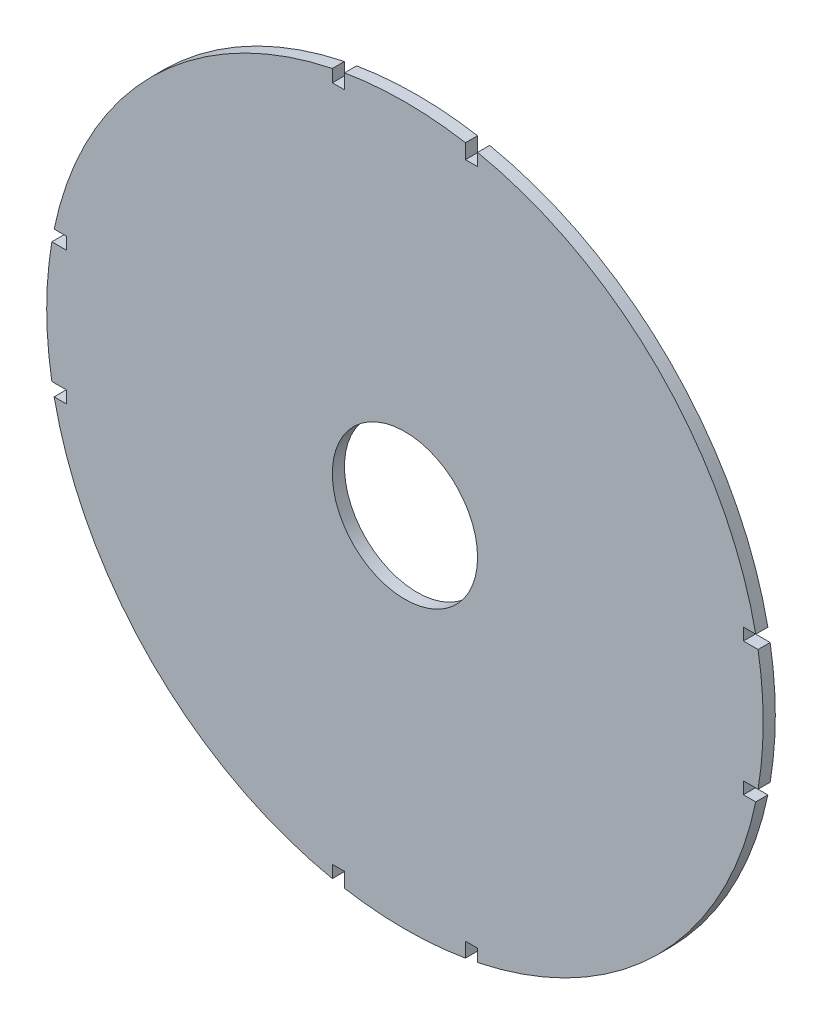
ISO-10303-21;
HEADER;
FILE_DESCRIPTION(('STEP AP214'),'2;1');
FILE_NAME('part.step','',(''),(''),'','','');
FILE_SCHEMA(('AUTOMOTIVE_DESIGN { 1 0 10303 214 1 1 1 1 }'));
ENDSEC;
DATA;
#1=APPLICATION_CONTEXT('core data for automotive mechanical design processes');
#2=APPLICATION_PROTOCOL_DEFINITION('international standard','automotive_design',2000,#1);
#3=PRODUCT_CONTEXT('',#1,'mechanical');
#4=PRODUCT('Part','Part','',(#3));
#5=PRODUCT_RELATED_PRODUCT_CATEGORY('part','',(#4));
#6=PRODUCT_DEFINITION_FORMATION('','',#4);
#7=PRODUCT_DEFINITION_CONTEXT('part definition',#1,'design');
#8=PRODUCT_DEFINITION('design','',#6,#7);
#9=PRODUCT_DEFINITION_SHAPE('','',#8);
#10=(LENGTH_UNIT() NAMED_UNIT(*) SI_UNIT(.MILLI.,.METRE.));
#11=(NAMED_UNIT(*) PLANE_ANGLE_UNIT() SI_UNIT($,.RADIAN.));
#12=(NAMED_UNIT(*) SI_UNIT($,.STERADIAN.) SOLID_ANGLE_UNIT());
#13=UNCERTAINTY_MEASURE_WITH_UNIT(LENGTH_MEASURE(1.E-05),#10,'distance_accuracy_value','');
#14=(GEOMETRIC_REPRESENTATION_CONTEXT(3) GLOBAL_UNCERTAINTY_ASSIGNED_CONTEXT((#13)) GLOBAL_UNIT_ASSIGNED_CONTEXT((#10,
#11,#12)) REPRESENTATION_CONTEXT('',''));
#15=CARTESIAN_POINT('',(0.,0.,0.));
#16=DIRECTION('',(0.,0.,1.));
#17=DIRECTION('',(1.,0.,0.));
#18=AXIS2_PLACEMENT_3D('',#15,#16,#17);
#19=CARTESIAN_POINT('',(0.,15.875,3.175));
#20=DIRECTION('',(0.,-1.,0.));
#21=DIRECTION('',(0.,0.,-1.));
#22=AXIS2_PLACEMENT_3D('',#19,#20,#21);
#23=PLANE('',#22);
#24=DIRECTION('',(-1.,0.,0.));
#25=VECTOR('',#24,1.);
#26=CARTESIAN_POINT('',(0.,15.875,0.));
#27=LINE('',#26,#25);
#28=CARTESIAN_POINT('',(-88.7742364311283,15.875,0.));
#29=VERTEX_POINT('',#28);
#30=CARTESIAN_POINT('',(-92.629502724564,15.875,0.));
#31=VERTEX_POINT('',#30);
#32=EDGE_CURVE('E281',#29,#31,#27,.T.);
#33=ORIENTED_EDGE('',*,*,#32,.T.);
#34=DIRECTION('',(0.,0.,-1.));
#35=VECTOR('',#34,1.);
#36=CARTESIAN_POINT('',(-92.629502724564,15.875,3.175));
#37=LINE('',#36,#35);
#38=CARTESIAN_POINT('',(-92.629502724564,15.875,3.175));
#39=VERTEX_POINT('',#38);
#40=EDGE_CURVE('E11',#39,#31,#37,.T.);
#41=ORIENTED_EDGE('',*,*,#40,.F.);
#42=DIRECTION('',(-1.,0.,0.));
#43=VECTOR('',#42,1.);
#44=CARTESIAN_POINT('',(0.,15.875,3.175));
#45=LINE('',#44,#43);
#46=CARTESIAN_POINT('',(-88.7742364311283,15.875,3.175));
#47=VERTEX_POINT('',#46);
#48=EDGE_CURVE('E449',#47,#39,#45,.T.);
#49=ORIENTED_EDGE('',*,*,#48,.F.);
#50=DIRECTION('',(0.,0.,-1.));
#51=VECTOR('',#50,1.);
#52=CARTESIAN_POINT('',(-88.7742364311283,15.875,3.175));
#53=LINE('',#52,#51);
#54=EDGE_CURVE('E274',#47,#29,#53,.T.);
#55=ORIENTED_EDGE('',*,*,#54,.T.);
#56=EDGE_LOOP('',(#33,#41,#49,#55));
#57=FACE_BOUND('',#56,.T.);
#58=ADVANCED_FACE('F37',(#57),#23,.F.);
#59=CARTESIAN_POINT('',(0.,0.,3.175));
#60=DIRECTION('',(0.,0.,-1.));
#61=DIRECTION('',(-1.,0.,0.));
#62=AXIS2_PLACEMENT_3D('',#59,#60,#61);
#63=CYLINDRICAL_SURFACE('',#62,93.98);
#64=CARTESIAN_POINT('',(0.,0.,0.));
#65=DIRECTION('',(0.,0.,1.));
#66=DIRECTION('',(1.,0.,0.));
#67=AXIS2_PLACEMENT_3D('',#64,#65,#66);
#68=CIRCLE('',#67,93.98);
#69=CARTESIAN_POINT('',(-92.629502724564,-15.875,0.));
#70=VERTEX_POINT('',#69);
#71=EDGE_CURVE('E284',#31,#70,#68,.T.);
#72=ORIENTED_EDGE('',*,*,#71,.T.);
#73=DIRECTION('',(0.,0.,-1.));
#74=VECTOR('',#73,1.);
#75=CARTESIAN_POINT('',(-92.629502724564,-15.875,3.175));
#76=LINE('',#75,#74);
#77=CARTESIAN_POINT('',(-92.629502724564,-15.875,3.175));
#78=VERTEX_POINT('',#77);
#79=EDGE_CURVE('E46',#78,#70,#76,.T.);
#80=ORIENTED_EDGE('',*,*,#79,.F.);
#81=CARTESIAN_POINT('',(0.,0.,3.175));
#82=DIRECTION('',(0.,0.,1.));
#83=DIRECTION('',(1.,0.,0.));
#84=AXIS2_PLACEMENT_3D('',#81,#82,#83);
#85=CIRCLE('',#84,93.98);
#86=EDGE_CURVE('E165',#39,#78,#85,.T.);
#87=ORIENTED_EDGE('',*,*,#86,.F.);
#88=ORIENTED_EDGE('',*,*,#40,.T.);
#89=EDGE_LOOP('',(#72,#80,#87,#88));
#90=FACE_BOUND('',#89,.T.);
#91=ADVANCED_FACE('F432',(#90),#63,.T.);
#92=CARTESIAN_POINT('',(0.,-15.875,3.175));
#93=DIRECTION('',(0.,-1.,0.));
#94=DIRECTION('',(0.,0.,-1.));
#95=AXIS2_PLACEMENT_3D('',#92,#93,#94);
#96=PLANE('',#95);
#97=DIRECTION('',(-1.,0.,0.));
#98=VECTOR('',#97,1.);
#99=CARTESIAN_POINT('',(0.,-15.875,0.));
#100=LINE('',#99,#98);
#101=CARTESIAN_POINT('',(-88.7742364311283,-15.875,0.));
#102=VERTEX_POINT('',#101);
#103=EDGE_CURVE('E287',#102,#70,#100,.T.);
#104=ORIENTED_EDGE('',*,*,#103,.F.);
#105=DIRECTION('',(0.,0.,-1.));
#106=VECTOR('',#105,1.);
#107=CARTESIAN_POINT('',(-88.7742364311283,-15.875,3.175));
#108=LINE('',#107,#106);
#109=CARTESIAN_POINT('',(-88.7742364311283,-15.875,3.175));
#110=VERTEX_POINT('',#109);
#111=EDGE_CURVE('E425',#110,#102,#108,.T.);
#112=ORIENTED_EDGE('',*,*,#111,.F.);
#113=DIRECTION('',(-1.,0.,0.));
#114=VECTOR('',#113,1.);
#115=CARTESIAN_POINT('',(0.,-15.875,3.175));
#116=LINE('',#115,#114);
#117=EDGE_CURVE('E431',#110,#78,#116,.T.);
#118=ORIENTED_EDGE('',*,*,#117,.T.);
#119=ORIENTED_EDGE('',*,*,#79,.T.);
#120=EDGE_LOOP('',(#104,#112,#118,#119));
#121=FACE_BOUND('',#120,.T.);
#122=ADVANCED_FACE('F429',(#121),#96,.T.);
#123=CARTESIAN_POINT('',(-88.7742364311283,0.,3.175));
#124=DIRECTION('',(-1.,0.,0.));
#125=DIRECTION('',(0.,0.,1.));
#126=AXIS2_PLACEMENT_3D('',#123,#124,#125);
#127=PLANE('',#126);
#128=DIRECTION('',(0.,1.,0.));
#129=VECTOR('',#128,1.);
#130=CARTESIAN_POINT('',(-88.7742364311283,0.,0.));
#131=LINE('',#130,#129);
#132=CARTESIAN_POINT('',(-88.7742364311283,-19.05,0.));
#133=VERTEX_POINT('',#132);
#134=EDGE_CURVE('E290',#133,#102,#131,.T.);
#135=ORIENTED_EDGE('',*,*,#134,.F.);
#136=DIRECTION('',(0.,0.,-1.));
#137=VECTOR('',#136,1.);
#138=CARTESIAN_POINT('',(-88.7742364311283,-19.05,3.175));
#139=LINE('',#138,#137);
#140=CARTESIAN_POINT('',(-88.7742364311283,-19.05,3.175));
#141=VERTEX_POINT('',#140);
#142=EDGE_CURVE('E423',#141,#133,#139,.T.);
#143=ORIENTED_EDGE('',*,*,#142,.F.);
#144=DIRECTION('',(0.,1.,0.));
#145=VECTOR('',#144,1.);
#146=CARTESIAN_POINT('',(-88.7742364311283,0.,3.175));
#147=LINE('',#146,#145);
#148=EDGE_CURVE('E445',#141,#110,#147,.T.);
#149=ORIENTED_EDGE('',*,*,#148,.T.);
#150=ORIENTED_EDGE('',*,*,#111,.T.);
#151=EDGE_LOOP('',(#135,#143,#149,#150));
#152=FACE_BOUND('',#151,.T.);
#153=ADVANCED_FACE('F441',(#152),#127,.T.);
#154=CARTESIAN_POINT('',(0.,-19.05,3.175));
#155=DIRECTION('',(0.,-1.,0.));
#156=DIRECTION('',(0.,0.,-1.));
#157=AXIS2_PLACEMENT_3D('',#154,#155,#156);
#158=PLANE('',#157);
#159=DIRECTION('',(-1.,0.,0.));
#160=VECTOR('',#159,1.);
#161=CARTESIAN_POINT('',(0.,-19.05,0.));
#162=LINE('',#161,#160);
#163=CARTESIAN_POINT('',(-92.029005753621,-19.05,0.));
#164=VERTEX_POINT('',#163);
#165=EDGE_CURVE('E293',#133,#164,#162,.T.);
#166=ORIENTED_EDGE('',*,*,#165,.T.);
#167=DIRECTION('',(0.,0.,-1.));
#168=VECTOR('',#167,1.);
#169=CARTESIAN_POINT('',(-92.029005753621,-19.05,3.175));
#170=LINE('',#169,#168);
#171=CARTESIAN_POINT('',(-92.029005753621,-19.05,3.175));
#172=VERTEX_POINT('',#171);
#173=EDGE_CURVE('E420',#172,#164,#170,.T.);
#174=ORIENTED_EDGE('',*,*,#173,.F.);
#175=DIRECTION('',(-1.,0.,0.));
#176=VECTOR('',#175,1.);
#177=CARTESIAN_POINT('',(0.,-19.05,3.175));
#178=LINE('',#177,#176);
#179=EDGE_CURVE('E447',#141,#172,#178,.T.);
#180=ORIENTED_EDGE('',*,*,#179,.F.);
#181=ORIENTED_EDGE('',*,*,#142,.T.);
#182=EDGE_LOOP('',(#166,#174,#180,#181));
#183=FACE_BOUND('',#182,.T.);
#184=ADVANCED_FACE('F540',(#183),#158,.F.);
#185=CARTESIAN_POINT('',(0.,0.,3.175));
#186=DIRECTION('',(0.,0.,-1.));
#187=DIRECTION('',(-1.,0.,0.));
#188=AXIS2_PLACEMENT_3D('',#185,#186,#187);
#189=CYLINDRICAL_SURFACE('',#188,93.98);
#190=CARTESIAN_POINT('',(0.,0.,0.));
#191=DIRECTION('',(0.,0.,1.));
#192=DIRECTION('',(1.,0.,0.));
#193=AXIS2_PLACEMENT_3D('',#190,#191,#192);
#194=CIRCLE('',#193,93.98);
#195=CARTESIAN_POINT('',(-19.05,-92.029005753621,0.));
#196=VERTEX_POINT('',#195);
#197=EDGE_CURVE('E295',#164,#196,#194,.T.);
#198=ORIENTED_EDGE('',*,*,#197,.T.);
#199=DIRECTION('',(0.,0.,-1.));
#200=VECTOR('',#199,1.);
#201=CARTESIAN_POINT('',(-19.05,-92.029005753621,3.175));
#202=LINE('',#201,#200);
#203=CARTESIAN_POINT('',(-19.05,-92.029005753621,3.175));
#204=VERTEX_POINT('',#203);
#205=EDGE_CURVE('E418',#204,#196,#202,.T.);
#206=ORIENTED_EDGE('',*,*,#205,.F.);
#207=CARTESIAN_POINT('',(0.,0.,3.175));
#208=DIRECTION('',(0.,0.,1.));
#209=DIRECTION('',(1.,0.,0.));
#210=AXIS2_PLACEMENT_3D('',#207,#208,#209);
#211=CIRCLE('',#210,93.98);
#212=EDGE_CURVE('E454',#172,#204,#211,.T.);
#213=ORIENTED_EDGE('',*,*,#212,.F.);
#214=ORIENTED_EDGE('',*,*,#173,.T.);
#215=EDGE_LOOP('',(#198,#206,#213,#214));
#216=FACE_BOUND('',#215,.T.);
#217=ADVANCED_FACE('F543',(#216),#189,.T.);
#218=CARTESIAN_POINT('',(-19.0500000000002,0.,3.175));
#219=DIRECTION('',(1.,0.,0.));
#220=DIRECTION('',(0.,1.,0.));
#221=AXIS2_PLACEMENT_3D('',#218,#219,#220);
#222=PLANE('',#221);
#223=DIRECTION('',(0.,-1.,0.));
#224=VECTOR('',#223,1.);
#225=CARTESIAN_POINT('',(-19.0500000000002,0.,0.));
#226=LINE('',#225,#224);
#227=CARTESIAN_POINT('',(-19.05,-88.7742364311283,0.));
#228=VERTEX_POINT('',#227);
#229=EDGE_CURVE('E298',#228,#196,#226,.T.);
#230=ORIENTED_EDGE('',*,*,#229,.F.);
#231=DIRECTION('',(0.,0.,-1.));
#232=VECTOR('',#231,1.);
#233=CARTESIAN_POINT('',(-19.05,-88.7742364311283,3.175));
#234=LINE('',#233,#232);
#235=CARTESIAN_POINT('',(-19.05,-88.7742364311283,3.175));
#236=VERTEX_POINT('',#235);
#237=EDGE_CURVE('E416',#236,#228,#234,.T.);
#238=ORIENTED_EDGE('',*,*,#237,.F.);
#239=DIRECTION('',(0.,-1.,0.));
#240=VECTOR('',#239,1.);
#241=CARTESIAN_POINT('',(-19.0500000000002,0.,3.175));
#242=LINE('',#241,#240);
#243=EDGE_CURVE('E456',#236,#204,#242,.T.);
#244=ORIENTED_EDGE('',*,*,#243,.T.);
#245=ORIENTED_EDGE('',*,*,#205,.T.);
#246=EDGE_LOOP('',(#230,#238,#244,#245));
#247=FACE_BOUND('',#246,.T.);
#248=ADVANCED_FACE('F547',(#247),#222,.T.);
#249=CARTESIAN_POINT('',(0.,-88.7742364311283,3.175));
#250=DIRECTION('',(0.,1.,0.));
#251=DIRECTION('',(0.,0.,1.));
#252=AXIS2_PLACEMENT_3D('',#249,#250,#251);
#253=PLANE('',#252);
#254=DIRECTION('',(1.,0.,0.));
#255=VECTOR('',#254,1.);
#256=CARTESIAN_POINT('',(0.,-88.7742364311283,0.));
#257=LINE('',#256,#255);
#258=CARTESIAN_POINT('',(-15.875,-88.7742364311283,0.));
#259=VERTEX_POINT('',#258);
#260=EDGE_CURVE('E301',#228,#259,#257,.T.);
#261=ORIENTED_EDGE('',*,*,#260,.T.);
#262=DIRECTION('',(0.,0.,-1.));
#263=VECTOR('',#262,1.);
#264=CARTESIAN_POINT('',(-15.875,-88.7742364311283,3.175));
#265=LINE('',#264,#263);
#266=CARTESIAN_POINT('',(-15.875,-88.7742364311283,3.175));
#267=VERTEX_POINT('',#266);
#268=EDGE_CURVE('E413',#267,#259,#265,.T.);
#269=ORIENTED_EDGE('',*,*,#268,.F.);
#270=DIRECTION('',(1.,0.,0.));
#271=VECTOR('',#270,1.);
#272=CARTESIAN_POINT('',(0.,-88.7742364311283,3.175));
#273=LINE('',#272,#271);
#274=EDGE_CURVE('E459',#236,#267,#273,.T.);
#275=ORIENTED_EDGE('',*,*,#274,.F.);
#276=ORIENTED_EDGE('',*,*,#237,.T.);
#277=EDGE_LOOP('',(#261,#269,#275,#276));
#278=FACE_BOUND('',#277,.T.);
#279=ADVANCED_FACE('F551',(#278),#253,.F.);
#280=CARTESIAN_POINT('',(-15.875,0.,3.175));
#281=DIRECTION('',(1.,0.,0.));
#282=DIRECTION('',(0.,0.,-1.));
#283=AXIS2_PLACEMENT_3D('',#280,#281,#282);
#284=PLANE('',#283);
#285=DIRECTION('',(0.,-1.,0.));
#286=VECTOR('',#285,1.);
#287=CARTESIAN_POINT('',(-15.875,0.,0.));
#288=LINE('',#287,#286);
#289=CARTESIAN_POINT('',(-15.875,-92.629502724564,0.));
#290=VERTEX_POINT('',#289);
#291=EDGE_CURVE('E303',#259,#290,#288,.T.);
#292=ORIENTED_EDGE('',*,*,#291,.T.);
#293=DIRECTION('',(0.,0.,-1.));
#294=VECTOR('',#293,1.);
#295=CARTESIAN_POINT('',(-15.875,-92.629502724564,3.175));
#296=LINE('',#295,#294);
#297=CARTESIAN_POINT('',(-15.875,-92.629502724564,3.175));
#298=VERTEX_POINT('',#297);
#299=EDGE_CURVE('E410',#298,#290,#296,.T.);
#300=ORIENTED_EDGE('',*,*,#299,.F.);
#301=DIRECTION('',(0.,-1.,0.));
#302=VECTOR('',#301,1.);
#303=CARTESIAN_POINT('',(-15.875,0.,3.175));
#304=LINE('',#303,#302);
#305=EDGE_CURVE('E461',#267,#298,#304,.T.);
#306=ORIENTED_EDGE('',*,*,#305,.F.);
#307=ORIENTED_EDGE('',*,*,#268,.T.);
#308=EDGE_LOOP('',(#292,#300,#306,#307));
#309=FACE_BOUND('',#308,.T.);
#310=ADVANCED_FACE('F555',(#309),#284,.F.);
#311=CARTESIAN_POINT('',(0.,0.,3.175));
#312=DIRECTION('',(0.,0.,-1.));
#313=DIRECTION('',(-1.,0.,0.));
#314=AXIS2_PLACEMENT_3D('',#311,#312,#313);
#315=CYLINDRICAL_SURFACE('',#314,93.98);
#316=CARTESIAN_POINT('',(0.,0.,0.));
#317=DIRECTION('',(0.,0.,1.));
#318=DIRECTION('',(1.,0.,0.));
#319=AXIS2_PLACEMENT_3D('',#316,#317,#318);
#320=CIRCLE('',#319,93.98);
#321=CARTESIAN_POINT('',(15.875,-92.629502724564,0.));
#322=VERTEX_POINT('',#321);
#323=EDGE_CURVE('E305',#290,#322,#320,.T.);
#324=ORIENTED_EDGE('',*,*,#323,.T.);
#325=DIRECTION('',(0.,0.,-1.));
#326=VECTOR('',#325,1.);
#327=CARTESIAN_POINT('',(15.875,-92.629502724564,3.175));
#328=LINE('',#327,#326);
#329=CARTESIAN_POINT('',(15.875,-92.629502724564,3.175));
#330=VERTEX_POINT('',#329);
#331=EDGE_CURVE('E408',#330,#322,#328,.T.);
#332=ORIENTED_EDGE('',*,*,#331,.F.);
#333=CARTESIAN_POINT('',(0.,0.,3.175));
#334=DIRECTION('',(0.,0.,1.));
#335=DIRECTION('',(1.,0.,0.));
#336=AXIS2_PLACEMENT_3D('',#333,#334,#335);
#337=CIRCLE('',#336,93.98);
#338=EDGE_CURVE('E463',#298,#330,#337,.T.);
#339=ORIENTED_EDGE('',*,*,#338,.F.);
#340=ORIENTED_EDGE('',*,*,#299,.T.);
#341=EDGE_LOOP('',(#324,#332,#339,#340));
#342=FACE_BOUND('',#341,.T.);
#343=ADVANCED_FACE('F559',(#342),#315,.T.);
#344=CARTESIAN_POINT('',(15.875,0.,3.175));
#345=DIRECTION('',(1.,0.,0.));
#346=DIRECTION('',(0.,0.,-1.));
#347=AXIS2_PLACEMENT_3D('',#344,#345,#346);
#348=PLANE('',#347);
#349=DIRECTION('',(0.,-1.,0.));
#350=VECTOR('',#349,1.);
#351=CARTESIAN_POINT('',(15.875,0.,0.));
#352=LINE('',#351,#350);
#353=CARTESIAN_POINT('',(15.875,-88.7742364311283,0.));
#354=VERTEX_POINT('',#353);
#355=EDGE_CURVE('E308',#354,#322,#352,.T.);
#356=ORIENTED_EDGE('',*,*,#355,.F.);
#357=DIRECTION('',(0.,0.,-1.));
#358=VECTOR('',#357,1.);
#359=CARTESIAN_POINT('',(15.875,-88.7742364311283,3.175));
#360=LINE('',#359,#358);
#361=CARTESIAN_POINT('',(15.875,-88.7742364311283,3.175));
#362=VERTEX_POINT('',#361);
#363=EDGE_CURVE('E406',#362,#354,#360,.T.);
#364=ORIENTED_EDGE('',*,*,#363,.F.);
#365=DIRECTION('',(0.,-1.,0.));
#366=VECTOR('',#365,1.);
#367=CARTESIAN_POINT('',(15.875,0.,3.175));
#368=LINE('',#367,#366);
#369=EDGE_CURVE('E465',#362,#330,#368,.T.);
#370=ORIENTED_EDGE('',*,*,#369,.T.);
#371=ORIENTED_EDGE('',*,*,#331,.T.);
#372=EDGE_LOOP('',(#356,#364,#370,#371));
#373=FACE_BOUND('',#372,.T.);
#374=ADVANCED_FACE('F563',(#373),#348,.T.);
#375=CARTESIAN_POINT('',(0.,-88.7742364311283,3.175));
#376=DIRECTION('',(0.,-1.,0.));
#377=DIRECTION('',(0.,0.,-1.));
#378=AXIS2_PLACEMENT_3D('',#375,#376,#377);
#379=PLANE('',#378);
#380=DIRECTION('',(-1.,0.,0.));
#381=VECTOR('',#380,1.);
#382=CARTESIAN_POINT('',(0.,-88.7742364311283,0.));
#383=LINE('',#382,#381);
#384=CARTESIAN_POINT('',(19.05,-88.7742364311283,0.));
#385=VERTEX_POINT('',#384);
#386=EDGE_CURVE('E311',#385,#354,#383,.T.);
#387=ORIENTED_EDGE('',*,*,#386,.F.);
#388=DIRECTION('',(0.,0.,-1.));
#389=VECTOR('',#388,1.);
#390=CARTESIAN_POINT('',(19.05,-88.7742364311283,3.175));
#391=LINE('',#390,#389);
#392=CARTESIAN_POINT('',(19.05,-88.7742364311283,3.175));
#393=VERTEX_POINT('',#392);
#394=EDGE_CURVE('E404',#393,#385,#391,.T.);
#395=ORIENTED_EDGE('',*,*,#394,.F.);
#396=DIRECTION('',(-1.,0.,0.));
#397=VECTOR('',#396,1.);
#398=CARTESIAN_POINT('',(0.,-88.7742364311283,3.175));
#399=LINE('',#398,#397);
#400=EDGE_CURVE('E468',#393,#362,#399,.T.);
#401=ORIENTED_EDGE('',*,*,#400,.T.);
#402=ORIENTED_EDGE('',*,*,#363,.T.);
#403=EDGE_LOOP('',(#387,#395,#401,#402));
#404=FACE_BOUND('',#403,.T.);
#405=ADVANCED_FACE('F567',(#404),#379,.T.);
#406=CARTESIAN_POINT('',(19.0500000000002,0.,3.175));
#407=DIRECTION('',(1.,0.,0.));
#408=DIRECTION('',(0.,1.,0.));
#409=AXIS2_PLACEMENT_3D('',#406,#407,#408);
#410=PLANE('',#409);
#411=DIRECTION('',(0.,-1.,0.));
#412=VECTOR('',#411,1.);
#413=CARTESIAN_POINT('',(19.0500000000002,0.,0.));
#414=LINE('',#413,#412);
#415=CARTESIAN_POINT('',(19.05,-92.029005753621,0.));
#416=VERTEX_POINT('',#415);
#417=EDGE_CURVE('E314',#385,#416,#414,.T.);
#418=ORIENTED_EDGE('',*,*,#417,.T.);
#419=DIRECTION('',(0.,0.,-1.));
#420=VECTOR('',#419,1.);
#421=CARTESIAN_POINT('',(19.05,-92.029005753621,3.175));
#422=LINE('',#421,#420);
#423=CARTESIAN_POINT('',(19.05,-92.029005753621,3.175));
#424=VERTEX_POINT('',#423);
#425=EDGE_CURVE('E401',#424,#416,#422,.T.);
#426=ORIENTED_EDGE('',*,*,#425,.F.);
#427=DIRECTION('',(0.,-1.,0.));
#428=VECTOR('',#427,1.);
#429=CARTESIAN_POINT('',(19.0500000000002,0.,3.175));
#430=LINE('',#429,#428);
#431=EDGE_CURVE('E471',#393,#424,#430,.T.);
#432=ORIENTED_EDGE('',*,*,#431,.F.);
#433=ORIENTED_EDGE('',*,*,#394,.T.);
#434=EDGE_LOOP('',(#418,#426,#432,#433));
#435=FACE_BOUND('',#434,.T.);
#436=ADVANCED_FACE('F571',(#435),#410,.F.);
#437=CARTESIAN_POINT('',(0.,0.,3.175));
#438=DIRECTION('',(0.,0.,-1.));
#439=DIRECTION('',(-1.,0.,0.));
#440=AXIS2_PLACEMENT_3D('',#437,#438,#439);
#441=CYLINDRICAL_SURFACE('',#440,93.98);
#442=CARTESIAN_POINT('',(0.,0.,0.));
#443=DIRECTION('',(0.,0.,1.));
#444=DIRECTION('',(1.,0.,0.));
#445=AXIS2_PLACEMENT_3D('',#442,#443,#444);
#446=CIRCLE('',#445,93.98);
#447=CARTESIAN_POINT('',(92.029005753621,-19.05,0.));
#448=VERTEX_POINT('',#447);
#449=EDGE_CURVE('E316',#416,#448,#446,.T.);
#450=ORIENTED_EDGE('',*,*,#449,.T.);
#451=DIRECTION('',(0.,0.,-1.));
#452=VECTOR('',#451,1.);
#453=CARTESIAN_POINT('',(92.029005753621,-19.05,3.175));
#454=LINE('',#453,#452);
#455=CARTESIAN_POINT('',(92.029005753621,-19.05,3.175));
#456=VERTEX_POINT('',#455);
#457=EDGE_CURVE('E399',#456,#448,#454,.T.);
#458=ORIENTED_EDGE('',*,*,#457,.F.);
#459=CARTESIAN_POINT('',(0.,0.,3.175));
#460=DIRECTION('',(0.,0.,1.));
#461=DIRECTION('',(1.,0.,0.));
#462=AXIS2_PLACEMENT_3D('',#459,#460,#461);
#463=CIRCLE('',#462,93.98);
#464=EDGE_CURVE('E473',#424,#456,#463,.T.);
#465=ORIENTED_EDGE('',*,*,#464,.F.);
#466=ORIENTED_EDGE('',*,*,#425,.T.);
#467=EDGE_LOOP('',(#450,#458,#465,#466));
#468=FACE_BOUND('',#467,.T.);
#469=ADVANCED_FACE('F575',(#468),#441,.T.);
#470=CARTESIAN_POINT('',(0.,-19.05,3.175));
#471=DIRECTION('',(0.,1.,0.));
#472=DIRECTION('',(0.,0.,1.));
#473=AXIS2_PLACEMENT_3D('',#470,#471,#472);
#474=PLANE('',#473);
#475=DIRECTION('',(1.,0.,0.));
#476=VECTOR('',#475,1.);
#477=CARTESIAN_POINT('',(0.,-19.05,0.));
#478=LINE('',#477,#476);
#479=CARTESIAN_POINT('',(88.7742364311283,-19.05,0.));
#480=VERTEX_POINT('',#479);
#481=EDGE_CURVE('E319',#480,#448,#478,.T.);
#482=ORIENTED_EDGE('',*,*,#481,.F.);
#483=DIRECTION('',(0.,0.,-1.));
#484=VECTOR('',#483,1.);
#485=CARTESIAN_POINT('',(88.7742364311283,-19.05,3.175));
#486=LINE('',#485,#484);
#487=CARTESIAN_POINT('',(88.7742364311283,-19.05,3.175));
#488=VERTEX_POINT('',#487);
#489=EDGE_CURVE('E397',#488,#480,#486,.T.);
#490=ORIENTED_EDGE('',*,*,#489,.F.);
#491=DIRECTION('',(1.,0.,0.));
#492=VECTOR('',#491,1.);
#493=CARTESIAN_POINT('',(0.,-19.05,3.175));
#494=LINE('',#493,#492);
#495=EDGE_CURVE('E475',#488,#456,#494,.T.);
#496=ORIENTED_EDGE('',*,*,#495,.T.);
#497=ORIENTED_EDGE('',*,*,#457,.T.);
#498=EDGE_LOOP('',(#482,#490,#496,#497));
#499=FACE_BOUND('',#498,.T.);
#500=ADVANCED_FACE('F579',(#499),#474,.T.);
#501=CARTESIAN_POINT('',(88.7742364311283,0.,3.175));
#502=DIRECTION('',(-1.,0.,0.));
#503=DIRECTION('',(0.,0.,1.));
#504=AXIS2_PLACEMENT_3D('',#501,#502,#503);
#505=PLANE('',#504);
#506=DIRECTION('',(0.,1.,0.));
#507=VECTOR('',#506,1.);
#508=CARTESIAN_POINT('',(88.7742364311283,0.,0.));
#509=LINE('',#508,#507);
#510=CARTESIAN_POINT('',(88.7742364311283,-15.875,0.));
#511=VERTEX_POINT('',#510);
#512=EDGE_CURVE('E322',#480,#511,#509,.T.);
#513=ORIENTED_EDGE('',*,*,#512,.T.);
#514=DIRECTION('',(0.,0.,-1.));
#515=VECTOR('',#514,1.);
#516=CARTESIAN_POINT('',(88.7742364311283,-15.875,3.175));
#517=LINE('',#516,#515);
#518=CARTESIAN_POINT('',(88.7742364311283,-15.875,3.175));
#519=VERTEX_POINT('',#518);
#520=EDGE_CURVE('E394',#519,#511,#517,.T.);
#521=ORIENTED_EDGE('',*,*,#520,.F.);
#522=DIRECTION('',(0.,1.,0.));
#523=VECTOR('',#522,1.);
#524=CARTESIAN_POINT('',(88.7742364311283,0.,3.175));
#525=LINE('',#524,#523);
#526=EDGE_CURVE('E478',#488,#519,#525,.T.);
#527=ORIENTED_EDGE('',*,*,#526,.F.);
#528=ORIENTED_EDGE('',*,*,#489,.T.);
#529=EDGE_LOOP('',(#513,#521,#527,#528));
#530=FACE_BOUND('',#529,.T.);
#531=ADVANCED_FACE('F583',(#530),#505,.F.);
#532=CARTESIAN_POINT('',(0.,-15.875,3.175));
#533=DIRECTION('',(0.,1.,0.));
#534=DIRECTION('',(0.,0.,1.));
#535=AXIS2_PLACEMENT_3D('',#532,#533,#534);
#536=PLANE('',#535);
#537=DIRECTION('',(1.,0.,0.));
#538=VECTOR('',#537,1.);
#539=CARTESIAN_POINT('',(0.,-15.875,0.));
#540=LINE('',#539,#538);
#541=CARTESIAN_POINT('',(92.629502724564,-15.875,0.));
#542=VERTEX_POINT('',#541);
#543=EDGE_CURVE('E324',#511,#542,#540,.T.);
#544=ORIENTED_EDGE('',*,*,#543,.T.);
#545=DIRECTION('',(0.,0.,-1.));
#546=VECTOR('',#545,1.);
#547=CARTESIAN_POINT('',(92.629502724564,-15.875,3.175));
#548=LINE('',#547,#546);
#549=CARTESIAN_POINT('',(92.629502724564,-15.875,3.175));
#550=VERTEX_POINT('',#549);
#551=EDGE_CURVE('E391',#550,#542,#548,.T.);
#552=ORIENTED_EDGE('',*,*,#551,.F.);
#553=DIRECTION('',(1.,0.,0.));
#554=VECTOR('',#553,1.);
#555=CARTESIAN_POINT('',(0.,-15.875,3.175));
#556=LINE('',#555,#554);
#557=EDGE_CURVE('E480',#519,#550,#556,.T.);
#558=ORIENTED_EDGE('',*,*,#557,.F.);
#559=ORIENTED_EDGE('',*,*,#520,.T.);
#560=EDGE_LOOP('',(#544,#552,#558,#559));
#561=FACE_BOUND('',#560,.T.);
#562=ADVANCED_FACE('F587',(#561),#536,.F.);
#563=CARTESIAN_POINT('',(0.,0.,3.175));
#564=DIRECTION('',(0.,0.,-1.));
#565=DIRECTION('',(-1.,0.,0.));
#566=AXIS2_PLACEMENT_3D('',#563,#564,#565);
#567=CYLINDRICAL_SURFACE('',#566,93.98);
#568=CARTESIAN_POINT('',(0.,0.,0.));
#569=DIRECTION('',(0.,0.,1.));
#570=DIRECTION('',(1.,0.,0.));
#571=AXIS2_PLACEMENT_3D('',#568,#569,#570);
#572=CIRCLE('',#571,93.98);
#573=CARTESIAN_POINT('',(92.629502724564,15.875,0.));
#574=VERTEX_POINT('',#573);
#575=EDGE_CURVE('E326',#542,#574,#572,.T.);
#576=ORIENTED_EDGE('',*,*,#575,.T.);
#577=DIRECTION('',(0.,0.,-1.));
#578=VECTOR('',#577,1.);
#579=CARTESIAN_POINT('',(92.629502724564,15.875,3.175));
#580=LINE('',#579,#578);
#581=CARTESIAN_POINT('',(92.629502724564,15.875,3.175));
#582=VERTEX_POINT('',#581);
#583=EDGE_CURVE('E389',#582,#574,#580,.T.);
#584=ORIENTED_EDGE('',*,*,#583,.F.);
#585=CARTESIAN_POINT('',(0.,0.,3.175));
#586=DIRECTION('',(0.,0.,1.));
#587=DIRECTION('',(1.,0.,0.));
#588=AXIS2_PLACEMENT_3D('',#585,#586,#587);
#589=CIRCLE('',#588,93.98);
#590=EDGE_CURVE('E482',#550,#582,#589,.T.);
#591=ORIENTED_EDGE('',*,*,#590,.F.);
#592=ORIENTED_EDGE('',*,*,#551,.T.);
#593=EDGE_LOOP('',(#576,#584,#591,#592));
#594=FACE_BOUND('',#593,.T.);
#595=ADVANCED_FACE('F591',(#594),#567,.T.);
#596=CARTESIAN_POINT('',(0.,15.875,3.175));
#597=DIRECTION('',(0.,1.,0.));
#598=DIRECTION('',(0.,0.,1.));
#599=AXIS2_PLACEMENT_3D('',#596,#597,#598);
#600=PLANE('',#599);
#601=DIRECTION('',(1.,0.,0.));
#602=VECTOR('',#601,1.);
#603=CARTESIAN_POINT('',(0.,15.875,0.));
#604=LINE('',#603,#602);
#605=CARTESIAN_POINT('',(88.7742364311283,15.875,0.));
#606=VERTEX_POINT('',#605);
#607=EDGE_CURVE('E329',#606,#574,#604,.T.);
#608=ORIENTED_EDGE('',*,*,#607,.F.);
#609=DIRECTION('',(0.,0.,-1.));
#610=VECTOR('',#609,1.);
#611=CARTESIAN_POINT('',(88.7742364311283,15.875,3.175));
#612=LINE('',#611,#610);
#613=CARTESIAN_POINT('',(88.7742364311283,15.875,3.175));
#614=VERTEX_POINT('',#613);
#615=EDGE_CURVE('E387',#614,#606,#612,.T.);
#616=ORIENTED_EDGE('',*,*,#615,.F.);
#617=DIRECTION('',(1.,0.,0.));
#618=VECTOR('',#617,1.);
#619=CARTESIAN_POINT('',(0.,15.875,3.175));
#620=LINE('',#619,#618);
#621=EDGE_CURVE('E484',#614,#582,#620,.T.);
#622=ORIENTED_EDGE('',*,*,#621,.T.);
#623=ORIENTED_EDGE('',*,*,#583,.T.);
#624=EDGE_LOOP('',(#608,#616,#622,#623));
#625=FACE_BOUND('',#624,.T.);
#626=ADVANCED_FACE('F595',(#625),#600,.T.);
#627=CARTESIAN_POINT('',(88.7742364311283,0.,3.175));
#628=DIRECTION('',(1.,0.,0.));
#629=DIRECTION('',(0.,0.,-1.));
#630=AXIS2_PLACEMENT_3D('',#627,#628,#629);
#631=PLANE('',#630);
#632=DIRECTION('',(0.,-1.,0.));
#633=VECTOR('',#632,1.);
#634=CARTESIAN_POINT('',(88.7742364311283,0.,0.));
#635=LINE('',#634,#633);
#636=CARTESIAN_POINT('',(88.7742364311283,19.05,0.));
#637=VERTEX_POINT('',#636);
#638=EDGE_CURVE('E332',#637,#606,#635,.T.);
#639=ORIENTED_EDGE('',*,*,#638,.F.);
#640=DIRECTION('',(0.,0.,-1.));
#641=VECTOR('',#640,1.);
#642=CARTESIAN_POINT('',(88.7742364311283,19.05,3.175));
#643=LINE('',#642,#641);
#644=CARTESIAN_POINT('',(88.7742364311283,19.05,3.175));
#645=VERTEX_POINT('',#644);
#646=EDGE_CURVE('E385',#645,#637,#643,.T.);
#647=ORIENTED_EDGE('',*,*,#646,.F.);
#648=DIRECTION('',(0.,-1.,0.));
#649=VECTOR('',#648,1.);
#650=CARTESIAN_POINT('',(88.7742364311283,0.,3.175));
#651=LINE('',#650,#649);
#652=EDGE_CURVE('E487',#645,#614,#651,.T.);
#653=ORIENTED_EDGE('',*,*,#652,.T.);
#654=ORIENTED_EDGE('',*,*,#615,.T.);
#655=EDGE_LOOP('',(#639,#647,#653,#654));
#656=FACE_BOUND('',#655,.T.);
#657=ADVANCED_FACE('F599',(#656),#631,.T.);
#658=CARTESIAN_POINT('',(0.,19.05,3.175));
#659=DIRECTION('',(0.,1.,0.));
#660=DIRECTION('',(0.,0.,1.));
#661=AXIS2_PLACEMENT_3D('',#658,#659,#660);
#662=PLANE('',#661);
#663=DIRECTION('',(1.,0.,0.));
#664=VECTOR('',#663,1.);
#665=CARTESIAN_POINT('',(0.,19.05,0.));
#666=LINE('',#665,#664);
#667=CARTESIAN_POINT('',(92.029005753621,19.05,0.));
#668=VERTEX_POINT('',#667);
#669=EDGE_CURVE('E335',#637,#668,#666,.T.);
#670=ORIENTED_EDGE('',*,*,#669,.T.);
#671=DIRECTION('',(0.,0.,-1.));
#672=VECTOR('',#671,1.);
#673=CARTESIAN_POINT('',(92.029005753621,19.05,3.175));
#674=LINE('',#673,#672);
#675=CARTESIAN_POINT('',(92.029005753621,19.05,3.175));
#676=VERTEX_POINT('',#675);
#677=EDGE_CURVE('E382',#676,#668,#674,.T.);
#678=ORIENTED_EDGE('',*,*,#677,.F.);
#679=DIRECTION('',(1.,0.,0.));
#680=VECTOR('',#679,1.);
#681=CARTESIAN_POINT('',(0.,19.05,3.175));
#682=LINE('',#681,#680);
#683=EDGE_CURVE('E490',#645,#676,#682,.T.);
#684=ORIENTED_EDGE('',*,*,#683,.F.);
#685=ORIENTED_EDGE('',*,*,#646,.T.);
#686=EDGE_LOOP('',(#670,#678,#684,#685));
#687=FACE_BOUND('',#686,.T.);
#688=ADVANCED_FACE('F603',(#687),#662,.F.);
#689=CARTESIAN_POINT('',(0.,0.,3.175));
#690=DIRECTION('',(0.,0.,-1.));
#691=DIRECTION('',(-1.,0.,0.));
#692=AXIS2_PLACEMENT_3D('',#689,#690,#691);
#693=CYLINDRICAL_SURFACE('',#692,93.98);
#694=CARTESIAN_POINT('',(0.,0.,0.));
#695=DIRECTION('',(0.,0.,1.));
#696=DIRECTION('',(1.,0.,0.));
#697=AXIS2_PLACEMENT_3D('',#694,#695,#696);
#698=CIRCLE('',#697,93.98);
#699=CARTESIAN_POINT('',(19.05,92.029005753621,0.));
#700=VERTEX_POINT('',#699);
#701=EDGE_CURVE('E337',#668,#700,#698,.T.);
#702=ORIENTED_EDGE('',*,*,#701,.T.);
#703=DIRECTION('',(0.,0.,-1.));
#704=VECTOR('',#703,1.);
#705=CARTESIAN_POINT('',(19.05,92.029005753621,3.175));
#706=LINE('',#705,#704);
#707=CARTESIAN_POINT('',(19.05,92.029005753621,3.175));
#708=VERTEX_POINT('',#707);
#709=EDGE_CURVE('E380',#708,#700,#706,.T.);
#710=ORIENTED_EDGE('',*,*,#709,.F.);
#711=CARTESIAN_POINT('',(0.,0.,3.175));
#712=DIRECTION('',(0.,0.,1.));
#713=DIRECTION('',(1.,0.,0.));
#714=AXIS2_PLACEMENT_3D('',#711,#712,#713);
#715=CIRCLE('',#714,93.98);
#716=EDGE_CURVE('E492',#676,#708,#715,.T.);
#717=ORIENTED_EDGE('',*,*,#716,.F.);
#718=ORIENTED_EDGE('',*,*,#677,.T.);
#719=EDGE_LOOP('',(#702,#710,#717,#718));
#720=FACE_BOUND('',#719,.T.);
#721=ADVANCED_FACE('F607',(#720),#693,.T.);
#722=CARTESIAN_POINT('',(19.0500000000002,0.,3.175));
#723=DIRECTION('',(-1.,0.,0.));
#724=DIRECTION('',(0.,-1.,0.));
#725=AXIS2_PLACEMENT_3D('',#722,#723,#724);
#726=PLANE('',#725);
#727=DIRECTION('',(0.,1.,0.));
#728=VECTOR('',#727,1.);
#729=CARTESIAN_POINT('',(19.0500000000002,0.,0.));
#730=LINE('',#729,#728);
#731=CARTESIAN_POINT('',(19.05,88.7742364311283,0.));
#732=VERTEX_POINT('',#731);
#733=EDGE_CURVE('E340',#732,#700,#730,.T.);
#734=ORIENTED_EDGE('',*,*,#733,.F.);
#735=DIRECTION('',(0.,0.,-1.));
#736=VECTOR('',#735,1.);
#737=CARTESIAN_POINT('',(19.05,88.7742364311283,3.175));
#738=LINE('',#737,#736);
#739=CARTESIAN_POINT('',(19.05,88.7742364311283,3.175));
#740=VERTEX_POINT('',#739);
#741=EDGE_CURVE('E378',#740,#732,#738,.T.);
#742=ORIENTED_EDGE('',*,*,#741,.F.);
#743=DIRECTION('',(0.,1.,0.));
#744=VECTOR('',#743,1.);
#745=CARTESIAN_POINT('',(19.0500000000002,0.,3.175));
#746=LINE('',#745,#744);
#747=EDGE_CURVE('E494',#740,#708,#746,.T.);
#748=ORIENTED_EDGE('',*,*,#747,.T.);
#749=ORIENTED_EDGE('',*,*,#709,.T.);
#750=EDGE_LOOP('',(#734,#742,#748,#749));
#751=FACE_BOUND('',#750,.T.);
#752=ADVANCED_FACE('F611',(#751),#726,.T.);
#753=CARTESIAN_POINT('',(0.,88.7742364311283,3.175));
#754=DIRECTION('',(0.,-1.,0.));
#755=DIRECTION('',(0.,0.,-1.));
#756=AXIS2_PLACEMENT_3D('',#753,#754,#755);
#757=PLANE('',#756);
#758=DIRECTION('',(-1.,0.,0.));
#759=VECTOR('',#758,1.);
#760=CARTESIAN_POINT('',(0.,88.7742364311283,0.));
#761=LINE('',#760,#759);
#762=CARTESIAN_POINT('',(15.875,88.7742364311283,0.));
#763=VERTEX_POINT('',#762);
#764=EDGE_CURVE('E343',#732,#763,#761,.T.);
#765=ORIENTED_EDGE('',*,*,#764,.T.);
#766=DIRECTION('',(0.,0.,-1.));
#767=VECTOR('',#766,1.);
#768=CARTESIAN_POINT('',(15.875,88.7742364311283,3.175));
#769=LINE('',#768,#767);
#770=CARTESIAN_POINT('',(15.875,88.7742364311283,3.175));
#771=VERTEX_POINT('',#770);
#772=EDGE_CURVE('E375',#771,#763,#769,.T.);
#773=ORIENTED_EDGE('',*,*,#772,.F.);
#774=DIRECTION('',(-1.,0.,0.));
#775=VECTOR('',#774,1.);
#776=CARTESIAN_POINT('',(0.,88.7742364311283,3.175));
#777=LINE('',#776,#775);
#778=EDGE_CURVE('E497',#740,#771,#777,.T.);
#779=ORIENTED_EDGE('',*,*,#778,.F.);
#780=ORIENTED_EDGE('',*,*,#741,.T.);
#781=EDGE_LOOP('',(#765,#773,#779,#780));
#782=FACE_BOUND('',#781,.T.);
#783=ADVANCED_FACE('F615',(#782),#757,.F.);
#784=CARTESIAN_POINT('',(15.875,0.,3.175));
#785=DIRECTION('',(-1.,0.,0.));
#786=DIRECTION('',(0.,0.,1.));
#787=AXIS2_PLACEMENT_3D('',#784,#785,#786);
#788=PLANE('',#787);
#789=DIRECTION('',(0.,1.,0.));
#790=VECTOR('',#789,1.);
#791=CARTESIAN_POINT('',(15.875,0.,0.));
#792=LINE('',#791,#790);
#793=CARTESIAN_POINT('',(15.875,92.629502724564,0.));
#794=VERTEX_POINT('',#793);
#795=EDGE_CURVE('E345',#763,#794,#792,.T.);
#796=ORIENTED_EDGE('',*,*,#795,.T.);
#797=DIRECTION('',(0.,0.,-1.));
#798=VECTOR('',#797,1.);
#799=CARTESIAN_POINT('',(15.875,92.629502724564,3.175));
#800=LINE('',#799,#798);
#801=CARTESIAN_POINT('',(15.875,92.629502724564,3.175));
#802=VERTEX_POINT('',#801);
#803=EDGE_CURVE('E372',#802,#794,#800,.T.);
#804=ORIENTED_EDGE('',*,*,#803,.F.);
#805=DIRECTION('',(0.,1.,0.));
#806=VECTOR('',#805,1.);
#807=CARTESIAN_POINT('',(15.875,0.,3.175));
#808=LINE('',#807,#806);
#809=EDGE_CURVE('E499',#771,#802,#808,.T.);
#810=ORIENTED_EDGE('',*,*,#809,.F.);
#811=ORIENTED_EDGE('',*,*,#772,.T.);
#812=EDGE_LOOP('',(#796,#804,#810,#811));
#813=FACE_BOUND('',#812,.T.);
#814=ADVANCED_FACE('F619',(#813),#788,.F.);
#815=CARTESIAN_POINT('',(0.,0.,3.175));
#816=DIRECTION('',(0.,0.,-1.));
#817=DIRECTION('',(-1.,0.,0.));
#818=AXIS2_PLACEMENT_3D('',#815,#816,#817);
#819=CYLINDRICAL_SURFACE('',#818,93.98);
#820=CARTESIAN_POINT('',(0.,0.,0.));
#821=DIRECTION('',(0.,0.,1.));
#822=DIRECTION('',(1.,0.,0.));
#823=AXIS2_PLACEMENT_3D('',#820,#821,#822);
#824=CIRCLE('',#823,93.98);
#825=CARTESIAN_POINT('',(-15.875,92.629502724564,0.));
#826=VERTEX_POINT('',#825);
#827=EDGE_CURVE('E347',#794,#826,#824,.T.);
#828=ORIENTED_EDGE('',*,*,#827,.T.);
#829=DIRECTION('',(0.,0.,-1.));
#830=VECTOR('',#829,1.);
#831=CARTESIAN_POINT('',(-15.875,92.629502724564,3.175));
#832=LINE('',#831,#830);
#833=CARTESIAN_POINT('',(-15.875,92.629502724564,3.175));
#834=VERTEX_POINT('',#833);
#835=EDGE_CURVE('E370',#834,#826,#832,.T.);
#836=ORIENTED_EDGE('',*,*,#835,.F.);
#837=CARTESIAN_POINT('',(0.,0.,3.175));
#838=DIRECTION('',(0.,0.,1.));
#839=DIRECTION('',(1.,0.,0.));
#840=AXIS2_PLACEMENT_3D('',#837,#838,#839);
#841=CIRCLE('',#840,93.98);
#842=EDGE_CURVE('E501',#802,#834,#841,.T.);
#843=ORIENTED_EDGE('',*,*,#842,.F.);
#844=ORIENTED_EDGE('',*,*,#803,.T.);
#845=EDGE_LOOP('',(#828,#836,#843,#844));
#846=FACE_BOUND('',#845,.T.);
#847=ADVANCED_FACE('F623',(#846),#819,.T.);
#848=CARTESIAN_POINT('',(-15.875,0.,3.175));
#849=DIRECTION('',(-1.,0.,0.));
#850=DIRECTION('',(0.,0.,1.));
#851=AXIS2_PLACEMENT_3D('',#848,#849,#850);
#852=PLANE('',#851);
#853=DIRECTION('',(0.,1.,0.));
#854=VECTOR('',#853,1.);
#855=CARTESIAN_POINT('',(-15.875,0.,0.));
#856=LINE('',#855,#854);
#857=CARTESIAN_POINT('',(-15.875,88.7742364311283,0.));
#858=VERTEX_POINT('',#857);
#859=EDGE_CURVE('E350',#858,#826,#856,.T.);
#860=ORIENTED_EDGE('',*,*,#859,.F.);
#861=DIRECTION('',(0.,0.,-1.));
#862=VECTOR('',#861,1.);
#863=CARTESIAN_POINT('',(-15.875,88.7742364311283,3.175));
#864=LINE('',#863,#862);
#865=CARTESIAN_POINT('',(-15.875,88.7742364311283,3.175));
#866=VERTEX_POINT('',#865);
#867=EDGE_CURVE('E368',#866,#858,#864,.T.);
#868=ORIENTED_EDGE('',*,*,#867,.F.);
#869=DIRECTION('',(0.,1.,0.));
#870=VECTOR('',#869,1.);
#871=CARTESIAN_POINT('',(-15.875,0.,3.175));
#872=LINE('',#871,#870);
#873=EDGE_CURVE('E503',#866,#834,#872,.T.);
#874=ORIENTED_EDGE('',*,*,#873,.T.);
#875=ORIENTED_EDGE('',*,*,#835,.T.);
#876=EDGE_LOOP('',(#860,#868,#874,#875));
#877=FACE_BOUND('',#876,.T.);
#878=ADVANCED_FACE('F516',(#877),#852,.T.);
#879=CARTESIAN_POINT('',(0.,88.7742364311283,3.175));
#880=DIRECTION('',(0.,1.,0.));
#881=DIRECTION('',(0.,0.,1.));
#882=AXIS2_PLACEMENT_3D('',#879,#880,#881);
#883=PLANE('',#882);
#884=DIRECTION('',(1.,0.,0.));
#885=VECTOR('',#884,1.);
#886=CARTESIAN_POINT('',(0.,88.7742364311283,0.));
#887=LINE('',#886,#885);
#888=CARTESIAN_POINT('',(-19.05,88.7742364311283,0.));
#889=VERTEX_POINT('',#888);
#890=EDGE_CURVE('E353',#889,#858,#887,.T.);
#891=ORIENTED_EDGE('',*,*,#890,.F.);
#892=DIRECTION('',(0.,0.,-1.));
#893=VECTOR('',#892,1.);
#894=CARTESIAN_POINT('',(-19.05,88.7742364311283,3.175));
#895=LINE('',#894,#893);
#896=CARTESIAN_POINT('',(-19.05,88.7742364311283,3.175));
#897=VERTEX_POINT('',#896);
#898=EDGE_CURVE('E366',#897,#889,#895,.T.);
#899=ORIENTED_EDGE('',*,*,#898,.F.);
#900=DIRECTION('',(1.,0.,0.));
#901=VECTOR('',#900,1.);
#902=CARTESIAN_POINT('',(0.,88.7742364311283,3.175));
#903=LINE('',#902,#901);
#904=EDGE_CURVE('E506',#897,#866,#903,.T.);
#905=ORIENTED_EDGE('',*,*,#904,.T.);
#906=ORIENTED_EDGE('',*,*,#867,.T.);
#907=EDGE_LOOP('',(#891,#899,#905,#906));
#908=FACE_BOUND('',#907,.T.);
#909=ADVANCED_FACE('F510',(#908),#883,.T.);
#910=CARTESIAN_POINT('',(-19.0500000000002,0.,3.175));
#911=DIRECTION('',(-1.,0.,0.));
#912=DIRECTION('',(0.,-1.,0.));
#913=AXIS2_PLACEMENT_3D('',#910,#911,#912);
#914=PLANE('',#913);
#915=DIRECTION('',(0.,1.,0.));
#916=VECTOR('',#915,1.);
#917=CARTESIAN_POINT('',(-19.0500000000002,0.,0.));
#918=LINE('',#917,#916);
#919=CARTESIAN_POINT('',(-19.05,92.029005753621,0.));
#920=VERTEX_POINT('',#919);
#921=EDGE_CURVE('E356',#889,#920,#918,.T.);
#922=ORIENTED_EDGE('',*,*,#921,.T.);
#923=DIRECTION('',(0.,0.,-1.));
#924=VECTOR('',#923,1.);
#925=CARTESIAN_POINT('',(-19.05,92.029005753621,3.175));
#926=LINE('',#925,#924);
#927=CARTESIAN_POINT('',(-19.05,92.029005753621,3.175));
#928=VERTEX_POINT('',#927);
#929=EDGE_CURVE('E270',#928,#920,#926,.T.);
#930=ORIENTED_EDGE('',*,*,#929,.F.);
#931=DIRECTION('',(0.,1.,0.));
#932=VECTOR('',#931,1.);
#933=CARTESIAN_POINT('',(-19.0500000000002,0.,3.175));
#934=LINE('',#933,#932);
#935=EDGE_CURVE('E257',#897,#928,#934,.T.);
#936=ORIENTED_EDGE('',*,*,#935,.F.);
#937=ORIENTED_EDGE('',*,*,#898,.T.);
#938=EDGE_LOOP('',(#922,#930,#936,#937));
#939=FACE_BOUND('',#938,.T.);
#940=ADVANCED_FACE('F520',(#939),#914,.F.);
#941=CARTESIAN_POINT('',(0.,0.,3.175));
#942=DIRECTION('',(0.,0.,-1.));
#943=DIRECTION('',(-1.,0.,0.));
#944=AXIS2_PLACEMENT_3D('',#941,#942,#943);
#945=CYLINDRICAL_SURFACE('',#944,93.98);
#946=CARTESIAN_POINT('',(0.,0.,0.));
#947=DIRECTION('',(0.,0.,1.));
#948=DIRECTION('',(1.,0.,0.));
#949=AXIS2_PLACEMENT_3D('',#946,#947,#948);
#950=CIRCLE('',#949,93.98);
#951=CARTESIAN_POINT('',(-92.029005753621,19.05,0.));
#952=VERTEX_POINT('',#951);
#953=EDGE_CURVE('E266',#920,#952,#950,.T.);
#954=ORIENTED_EDGE('',*,*,#953,.T.);
#955=DIRECTION('',(0.,0.,-1.));
#956=VECTOR('',#955,1.);
#957=CARTESIAN_POINT('',(-92.029005753621,19.05,3.175));
#958=LINE('',#957,#956);
#959=CARTESIAN_POINT('',(-92.029005753621,19.05,3.175));
#960=VERTEX_POINT('',#959);
#961=EDGE_CURVE('E263',#960,#952,#958,.T.);
#962=ORIENTED_EDGE('',*,*,#961,.F.);
#963=CARTESIAN_POINT('',(0.,0.,3.175));
#964=DIRECTION('',(0.,0.,1.));
#965=DIRECTION('',(1.,0.,0.));
#966=AXIS2_PLACEMENT_3D('',#963,#964,#965);
#967=CIRCLE('',#966,93.98);
#968=EDGE_CURVE('E250',#928,#960,#967,.T.);
#969=ORIENTED_EDGE('',*,*,#968,.F.);
#970=ORIENTED_EDGE('',*,*,#929,.T.);
#971=EDGE_LOOP('',(#954,#962,#969,#970));
#972=FACE_BOUND('',#971,.T.);
#973=ADVANCED_FACE('F264',(#972),#945,.T.);
#974=CARTESIAN_POINT('',(0.,19.05,3.175));
#975=DIRECTION('',(0.,-1.,0.));
#976=DIRECTION('',(0.,0.,-1.));
#977=AXIS2_PLACEMENT_3D('',#974,#975,#976);
#978=PLANE('',#977);
#979=DIRECTION('',(-1.,0.,0.));
#980=VECTOR('',#979,1.);
#981=CARTESIAN_POINT('',(0.,19.05,0.));
#982=LINE('',#981,#980);
#983=CARTESIAN_POINT('',(-88.7742364311283,19.05,0.));
#984=VERTEX_POINT('',#983);
#985=EDGE_CURVE('E359',#984,#952,#982,.T.);
#986=ORIENTED_EDGE('',*,*,#985,.F.);
#987=DIRECTION('',(0.,0.,-1.));
#988=VECTOR('',#987,1.);
#989=CARTESIAN_POINT('',(-88.7742364311283,19.05,3.175));
#990=LINE('',#989,#988);
#991=CARTESIAN_POINT('',(-88.7742364311283,19.05,3.175));
#992=VERTEX_POINT('',#991);
#993=EDGE_CURVE('E154',#992,#984,#990,.T.);
#994=ORIENTED_EDGE('',*,*,#993,.F.);
#995=DIRECTION('',(-1.,0.,0.));
#996=VECTOR('',#995,1.);
#997=CARTESIAN_POINT('',(0.,19.05,3.175));
#998=LINE('',#997,#996);
#999=EDGE_CURVE('E254',#992,#960,#998,.T.);
#1000=ORIENTED_EDGE('',*,*,#999,.T.);
#1001=ORIENTED_EDGE('',*,*,#961,.T.);
#1002=EDGE_LOOP('',(#986,#994,#1000,#1001));
#1003=FACE_BOUND('',#1002,.T.);
#1004=ADVANCED_FACE('F272',(#1003),#978,.T.);
#1005=CARTESIAN_POINT('',(0.,0.,3.175));
#1006=DIRECTION('',(0.,0.,-1.));
#1007=DIRECTION('',(-1.,0.,0.));
#1008=AXIS2_PLACEMENT_3D('',#1005,#1006,#1007);
#1009=CYLINDRICAL_SURFACE('',#1008,19.05);
#1010=CARTESIAN_POINT('',(0.,0.,3.175));
#1011=DIRECTION('',(0.,0.,1.));
#1012=DIRECTION('',(1.,0.,0.));
#1013=AXIS2_PLACEMENT_3D('',#1010,#1011,#1012);
#1014=CIRCLE('',#1013,19.05);
#1015=CARTESIAN_POINT('',(19.05,0.,3.175));
#1016=VERTEX_POINT('',#1015);
#1017=EDGE_CURVE('E362',#1016,#1016,#1014,.T.);
#1018=ORIENTED_EDGE('',*,*,#1017,.T.);
#1019=EDGE_LOOP('',(#1018));
#1020=FACE_BOUND('',#1019,.T.);
#1021=CARTESIAN_POINT('',(0.,0.,0.));
#1022=DIRECTION('',(0.,0.,1.));
#1023=DIRECTION('',(1.,0.,0.));
#1024=AXIS2_PLACEMENT_3D('',#1021,#1022,#1023);
#1025=CIRCLE('',#1024,19.05);
#1026=CARTESIAN_POINT('',(19.05,0.,0.));
#1027=VERTEX_POINT('',#1026);
#1028=EDGE_CURVE('E278',#1027,#1027,#1025,.T.);
#1029=ORIENTED_EDGE('',*,*,#1028,.F.);
#1030=EDGE_LOOP('',(#1029));
#1031=FACE_BOUND('',#1030,.T.);
#1032=ADVANCED_FACE('F39',(#1020,#1031),#1009,.F.);
#1033=CARTESIAN_POINT('',(-88.7742364311283,0.,3.175));
#1034=DIRECTION('',(1.,0.,0.));
#1035=DIRECTION('',(0.,0.,-1.));
#1036=AXIS2_PLACEMENT_3D('',#1033,#1034,#1035);
#1037=PLANE('',#1036);
#1038=DIRECTION('',(0.,-1.,0.));
#1039=VECTOR('',#1038,1.);
#1040=CARTESIAN_POINT('',(-88.7742364311283,0.,0.));
#1041=LINE('',#1040,#1039);
#1042=EDGE_CURVE('E157',#984,#29,#1041,.T.);
#1043=ORIENTED_EDGE('',*,*,#1042,.T.);
#1044=ORIENTED_EDGE('',*,*,#54,.F.);
#1045=DIRECTION('',(0.,-1.,0.));
#1046=VECTOR('',#1045,1.);
#1047=CARTESIAN_POINT('',(-88.7742364311283,0.,3.175));
#1048=LINE('',#1047,#1046);
#1049=EDGE_CURVE('E54',#992,#47,#1048,.T.);
#1050=ORIENTED_EDGE('',*,*,#1049,.F.);
#1051=ORIENTED_EDGE('',*,*,#993,.T.);
#1052=EDGE_LOOP('',(#1043,#1044,#1050,#1051));
#1053=FACE_BOUND('',#1052,.T.);
#1054=ADVANCED_FACE('F666',(#1053),#1037,.F.);
#1055=CARTESIAN_POINT('',(0.,0.,3.175));
#1056=DIRECTION('',(0.,0.,1.));
#1057=DIRECTION('',(1.,0.,0.));
#1058=AXIS2_PLACEMENT_3D('',#1055,#1056,#1057);
#1059=PLANE('',#1058);
#1060=ORIENTED_EDGE('',*,*,#1017,.F.);
#1061=EDGE_LOOP('',(#1060));
#1062=FACE_BOUND('',#1061,.T.);
#1063=ORIENTED_EDGE('',*,*,#48,.T.);
#1064=ORIENTED_EDGE('',*,*,#86,.T.);
#1065=ORIENTED_EDGE('',*,*,#117,.F.);
#1066=ORIENTED_EDGE('',*,*,#148,.F.);
#1067=ORIENTED_EDGE('',*,*,#179,.T.);
#1068=ORIENTED_EDGE('',*,*,#212,.T.);
#1069=ORIENTED_EDGE('',*,*,#243,.F.);
#1070=ORIENTED_EDGE('',*,*,#274,.T.);
#1071=ORIENTED_EDGE('',*,*,#305,.T.);
#1072=ORIENTED_EDGE('',*,*,#338,.T.);
#1073=ORIENTED_EDGE('',*,*,#369,.F.);
#1074=ORIENTED_EDGE('',*,*,#400,.F.);
#1075=ORIENTED_EDGE('',*,*,#431,.T.);
#1076=ORIENTED_EDGE('',*,*,#464,.T.);
#1077=ORIENTED_EDGE('',*,*,#495,.F.);
#1078=ORIENTED_EDGE('',*,*,#526,.T.);
#1079=ORIENTED_EDGE('',*,*,#557,.T.);
#1080=ORIENTED_EDGE('',*,*,#590,.T.);
#1081=ORIENTED_EDGE('',*,*,#621,.F.);
#1082=ORIENTED_EDGE('',*,*,#652,.F.);
#1083=ORIENTED_EDGE('',*,*,#683,.T.);
#1084=ORIENTED_EDGE('',*,*,#716,.T.);
#1085=ORIENTED_EDGE('',*,*,#747,.F.);
#1086=ORIENTED_EDGE('',*,*,#778,.T.);
#1087=ORIENTED_EDGE('',*,*,#809,.T.);
#1088=ORIENTED_EDGE('',*,*,#842,.T.);
#1089=ORIENTED_EDGE('',*,*,#873,.F.);
#1090=ORIENTED_EDGE('',*,*,#904,.F.);
#1091=ORIENTED_EDGE('',*,*,#935,.T.);
#1092=ORIENTED_EDGE('',*,*,#968,.T.);
#1093=ORIENTED_EDGE('',*,*,#999,.F.);
#1094=ORIENTED_EDGE('',*,*,#1049,.T.);
#1095=EDGE_LOOP('',(#1063,#1064,#1065,#1066,#1067,#1068,#1069,#1070,#1071,#1072,#1073,#1074,
#1075,#1076,#1077,#1078,#1079,#1080,#1081,#1082,#1083,#1084,#1085,#1086,#1087,#1088,#1089,#1090,
#1091,#1092,#1093,#1094));
#1096=FACE_BOUND('',#1095,.T.);
#1097=ADVANCED_FACE('F252',(#1062,#1096),#1059,.T.);
#1098=CARTESIAN_POINT('',(0.,0.,0.));
#1099=DIRECTION('',(0.,0.,1.));
#1100=DIRECTION('',(1.,0.,0.));
#1101=AXIS2_PLACEMENT_3D('',#1098,#1099,#1100);
#1102=PLANE('',#1101);
#1103=ORIENTED_EDGE('',*,*,#1028,.T.);
#1104=EDGE_LOOP('',(#1103));
#1105=FACE_BOUND('',#1104,.T.);
#1106=ORIENTED_EDGE('',*,*,#32,.F.);
#1107=ORIENTED_EDGE('',*,*,#1042,.F.);
#1108=ORIENTED_EDGE('',*,*,#985,.T.);
#1109=ORIENTED_EDGE('',*,*,#953,.F.);
#1110=ORIENTED_EDGE('',*,*,#921,.F.);
#1111=ORIENTED_EDGE('',*,*,#890,.T.);
#1112=ORIENTED_EDGE('',*,*,#859,.T.);
#1113=ORIENTED_EDGE('',*,*,#827,.F.);
#1114=ORIENTED_EDGE('',*,*,#795,.F.);
#1115=ORIENTED_EDGE('',*,*,#764,.F.);
#1116=ORIENTED_EDGE('',*,*,#733,.T.);
#1117=ORIENTED_EDGE('',*,*,#701,.F.);
#1118=ORIENTED_EDGE('',*,*,#669,.F.);
#1119=ORIENTED_EDGE('',*,*,#638,.T.);
#1120=ORIENTED_EDGE('',*,*,#607,.T.);
#1121=ORIENTED_EDGE('',*,*,#575,.F.);
#1122=ORIENTED_EDGE('',*,*,#543,.F.);
#1123=ORIENTED_EDGE('',*,*,#512,.F.);
#1124=ORIENTED_EDGE('',*,*,#481,.T.);
#1125=ORIENTED_EDGE('',*,*,#449,.F.);
#1126=ORIENTED_EDGE('',*,*,#417,.F.);
#1127=ORIENTED_EDGE('',*,*,#386,.T.);
#1128=ORIENTED_EDGE('',*,*,#355,.T.);
#1129=ORIENTED_EDGE('',*,*,#323,.F.);
#1130=ORIENTED_EDGE('',*,*,#291,.F.);
#1131=ORIENTED_EDGE('',*,*,#260,.F.);
#1132=ORIENTED_EDGE('',*,*,#229,.T.);
#1133=ORIENTED_EDGE('',*,*,#197,.F.);
#1134=ORIENTED_EDGE('',*,*,#165,.F.);
#1135=ORIENTED_EDGE('',*,*,#134,.T.);
#1136=ORIENTED_EDGE('',*,*,#103,.T.);
#1137=ORIENTED_EDGE('',*,*,#71,.F.);
#1138=EDGE_LOOP('',(#1106,#1107,#1108,#1109,#1110,#1111,#1112,#1113,#1114,#1115,#1116,#1117,
#1118,#1119,#1120,#1121,#1122,#1123,#1124,#1125,#1126,#1127,#1128,#1129,#1130,#1131,#1132,#1133,
#1134,#1135,#1136,#1137));
#1139=FACE_BOUND('',#1138,.T.);
#1140=ADVANCED_FACE('F436',(#1105,#1139),#1102,.F.);
#1141=CLOSED_SHELL('',(#58,#91,#122,#153,#184,#217,#248,#279,#310,#343,#374,#405,#436,#469,#500,
#531,#562,#595,#626,#657,#688,#721,#752,#783,#814,#847,#878,#909,#940,#973,#1004,#1032,#1054,
#1097,#1140));
#1142=MANIFOLD_SOLID_BREP('B2',#1141);
#1143=ADVANCED_BREP_SHAPE_REPRESENTATION('',(#18,#1142),#14);
#1144=SHAPE_DEFINITION_REPRESENTATION(#9,#1143);
ENDSEC;
END-ISO-10303-21;
